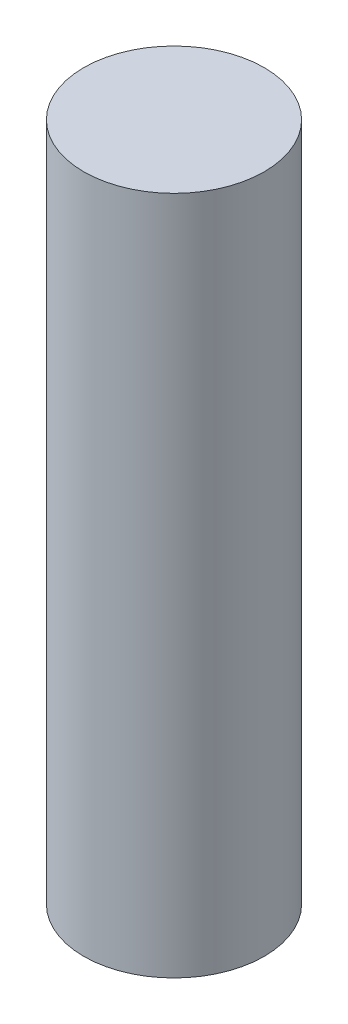
ISO-10303-21;
HEADER;
FILE_DESCRIPTION(('STEP AP214'),'2;1');
FILE_NAME('part.step','',(''),(''),'','','');
FILE_SCHEMA(('AUTOMOTIVE_DESIGN { 1 0 10303 214 1 1 1 1 }'));
ENDSEC;
DATA;
#1=APPLICATION_CONTEXT('core data for automotive mechanical design processes');
#2=APPLICATION_PROTOCOL_DEFINITION('international standard','automotive_design',2000,#1);
#3=PRODUCT_CONTEXT('',#1,'mechanical');
#4=PRODUCT('Part','Part','',(#3));
#5=PRODUCT_RELATED_PRODUCT_CATEGORY('part','',(#4));
#6=PRODUCT_DEFINITION_FORMATION('','',#4);
#7=PRODUCT_DEFINITION_CONTEXT('part definition',#1,'design');
#8=PRODUCT_DEFINITION('design','',#6,#7);
#9=PRODUCT_DEFINITION_SHAPE('','',#8);
#10=(LENGTH_UNIT() NAMED_UNIT(*) SI_UNIT(.MILLI.,.METRE.));
#11=(NAMED_UNIT(*) PLANE_ANGLE_UNIT() SI_UNIT($,.RADIAN.));
#12=(NAMED_UNIT(*) SI_UNIT($,.STERADIAN.) SOLID_ANGLE_UNIT());
#13=UNCERTAINTY_MEASURE_WITH_UNIT(LENGTH_MEASURE(1.E-05),#10,'distance_accuracy_value','');
#14=(GEOMETRIC_REPRESENTATION_CONTEXT(3) GLOBAL_UNCERTAINTY_ASSIGNED_CONTEXT((#13)) GLOBAL_UNIT_ASSIGNED_CONTEXT((#10,
#11,#12)) REPRESENTATION_CONTEXT('',''));
#15=CARTESIAN_POINT('',(0.,0.,0.));
#16=DIRECTION('',(0.,0.,1.));
#17=DIRECTION('',(1.,0.,0.));
#18=AXIS2_PLACEMENT_3D('',#15,#16,#17);
#19=CARTESIAN_POINT('',(0.,32.,0.));
#20=DIRECTION('',(0.,-1.,0.));
#21=DIRECTION('',(0.,0.,-1.));
#22=AXIS2_PLACEMENT_3D('',#19,#20,#21);
#23=CYLINDRICAL_SURFACE('',#22,4.25);
#24=CARTESIAN_POINT('',(0.,32.,0.));
#25=DIRECTION('',(0.,1.,0.));
#26=DIRECTION('',(0.,0.,1.));
#27=AXIS2_PLACEMENT_3D('',#24,#25,#26);
#28=CIRCLE('',#27,4.25);
#29=CARTESIAN_POINT('',(0.,32.,4.25));
#30=VERTEX_POINT('',#29);
#31=EDGE_CURVE('E10',#30,#30,#28,.T.);
#32=ORIENTED_EDGE('',*,*,#31,.F.);
#33=EDGE_LOOP('',(#32));
#34=FACE_BOUND('',#33,.T.);
#35=CARTESIAN_POINT('',(0.,0.,0.));
#36=DIRECTION('',(0.,1.,0.));
#37=DIRECTION('',(0.,0.,1.));
#38=AXIS2_PLACEMENT_3D('',#35,#36,#37);
#39=CIRCLE('',#38,4.25);
#40=CARTESIAN_POINT('',(0.,0.,4.25));
#41=VERTEX_POINT('',#40);
#42=EDGE_CURVE('E33',#41,#41,#39,.T.);
#43=ORIENTED_EDGE('',*,*,#42,.T.);
#44=EDGE_LOOP('',(#43));
#45=FACE_BOUND('',#44,.T.);
#46=ADVANCED_FACE('F30',(#34,#45),#23,.T.);
#47=CARTESIAN_POINT('',(0.,32.,0.));
#48=DIRECTION('',(0.,1.,0.));
#49=DIRECTION('',(0.,0.,1.));
#50=AXIS2_PLACEMENT_3D('',#47,#48,#49);
#51=PLANE('',#50);
#52=ORIENTED_EDGE('',*,*,#31,.T.);
#53=EDGE_LOOP('',(#52));
#54=FACE_BOUND('',#53,.T.);
#55=ADVANCED_FACE('F45',(#54),#51,.T.);
#56=CARTESIAN_POINT('',(0.,0.,0.));
#57=DIRECTION('',(0.,1.,0.));
#58=DIRECTION('',(0.,0.,1.));
#59=AXIS2_PLACEMENT_3D('',#56,#57,#58);
#60=PLANE('',#59);
#61=ORIENTED_EDGE('',*,*,#42,.F.);
#62=EDGE_LOOP('',(#61));
#63=FACE_BOUND('',#62,.T.);
#64=ADVANCED_FACE('F43',(#63),#60,.F.);
#65=CLOSED_SHELL('',(#46,#55,#64));
#66=MANIFOLD_SOLID_BREP('B2',#65);
#67=ADVANCED_BREP_SHAPE_REPRESENTATION('',(#18,#66),#14);
#68=SHAPE_DEFINITION_REPRESENTATION(#9,#67);
ENDSEC;
END-ISO-10303-21;
